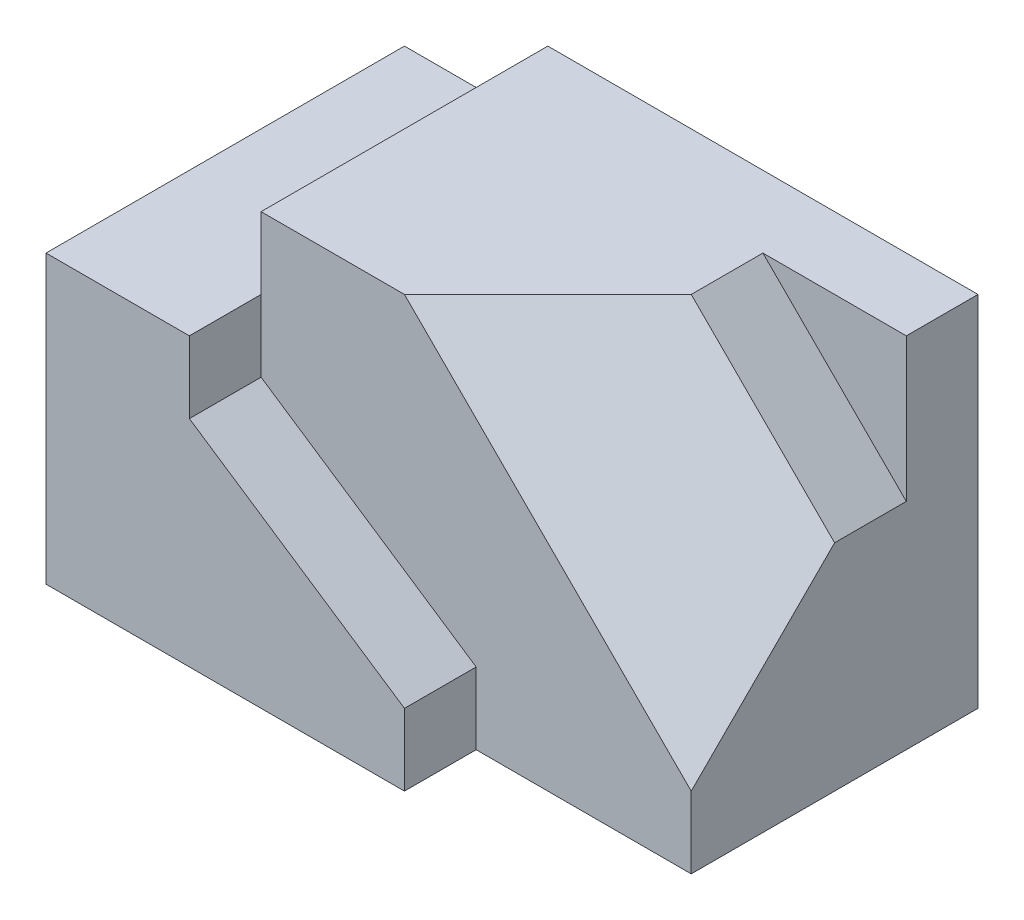
ISO-10303-21;
HEADER;
FILE_DESCRIPTION(('STEP AP214'),'2;1');
FILE_NAME('part.step','',(''),(''),'','','');
FILE_SCHEMA(('AUTOMOTIVE_DESIGN { 1 0 10303 214 1 1 1 1 }'));
ENDSEC;
DATA;
#1=APPLICATION_CONTEXT('core data for automotive mechanical design processes');
#2=APPLICATION_PROTOCOL_DEFINITION('international standard','automotive_design',2000,#1);
#3=PRODUCT_CONTEXT('',#1,'mechanical');
#4=PRODUCT('Part','Part','',(#3));
#5=PRODUCT_RELATED_PRODUCT_CATEGORY('part','',(#4));
#6=PRODUCT_DEFINITION_FORMATION('','',#4);
#7=PRODUCT_DEFINITION_CONTEXT('part definition',#1,'design');
#8=PRODUCT_DEFINITION('design','',#6,#7);
#9=PRODUCT_DEFINITION_SHAPE('','',#8);
#10=(LENGTH_UNIT() NAMED_UNIT(*) SI_UNIT(.MILLI.,.METRE.));
#11=(NAMED_UNIT(*) PLANE_ANGLE_UNIT() SI_UNIT($,.RADIAN.));
#12=(NAMED_UNIT(*) SI_UNIT($,.STERADIAN.) SOLID_ANGLE_UNIT());
#13=UNCERTAINTY_MEASURE_WITH_UNIT(LENGTH_MEASURE(1.E-05),#10,'distance_accuracy_value','');
#14=(GEOMETRIC_REPRESENTATION_CONTEXT(3) GLOBAL_UNCERTAINTY_ASSIGNED_CONTEXT((#13)) GLOBAL_UNIT_ASSIGNED_CONTEXT((#10,
#11,#12)) REPRESENTATION_CONTEXT('',''));
#15=CARTESIAN_POINT('',(0.,0.,0.));
#16=DIRECTION('',(0.,0.,1.));
#17=DIRECTION('',(1.,0.,0.));
#18=AXIS2_PLACEMENT_3D('',#15,#16,#17);
#19=CARTESIAN_POINT('',(80.,0.,-10.));
#20=DIRECTION('',(0.,0.,-1.));
#21=DIRECTION('',(-1.,0.,0.));
#22=AXIS2_PLACEMENT_3D('',#19,#20,#21);
#23=PLANE('',#22);
#24=DIRECTION('',(0.,1.,0.));
#25=VECTOR('',#24,1.);
#26=CARTESIAN_POINT('',(80.,0.,-10.));
#27=LINE('',#26,#25);
#28=CARTESIAN_POINT('',(80.,0.,-10.));
#29=VERTEX_POINT('',#28);
#30=CARTESIAN_POINT('',(80.,10.,-9.99999999999998));
#31=VERTEX_POINT('',#30);
#32=EDGE_CURVE('E142',#29,#31,#27,.T.);
#33=ORIENTED_EDGE('',*,*,#32,.T.);
#34=DIRECTION('',(-0.707106781186547,0.707106781186548,0.));
#35=VECTOR('',#34,1.);
#36=CARTESIAN_POINT('',(80.,10.,-9.99999999999998));
#37=LINE('',#36,#35);
#38=CARTESIAN_POINT('',(40.,50.,-9.99999999999998));
#39=VERTEX_POINT('',#38);
#40=EDGE_CURVE('E130',#31,#39,#37,.T.);
#41=ORIENTED_EDGE('',*,*,#40,.T.);
#42=DIRECTION('',(1.,0.,0.));
#43=VECTOR('',#42,1.);
#44=CARTESIAN_POINT('',(80.,50.,-10.));
#45=LINE('',#44,#43);
#46=CARTESIAN_POINT('',(20.,50.,-9.99999999999999));
#47=VERTEX_POINT('',#46);
#48=EDGE_CURVE('E140',#47,#39,#45,.T.);
#49=ORIENTED_EDGE('',*,*,#48,.F.);
#50=DIRECTION('',(0.,-1.,0.));
#51=VECTOR('',#50,1.);
#52=CARTESIAN_POINT('',(20.,50.,-9.99999999999999));
#53=LINE('',#52,#51);
#54=CARTESIAN_POINT('',(20.,40.,-9.99999999999999));
#55=VERTEX_POINT('',#54);
#56=EDGE_CURVE('E150',#47,#55,#53,.T.);
#57=ORIENTED_EDGE('',*,*,#56,.T.);
#58=CARTESIAN_POINT('',(20.,30.,-9.99999999999999));
#59=VERTEX_POINT('',#58);
#60=EDGE_CURVE('E148',#55,#59,#53,.T.);
#61=ORIENTED_EDGE('',*,*,#60,.T.);
#62=DIRECTION('',(-0.832050294337844,0.554700196225229,0.));
#63=VECTOR('',#62,1.);
#64=CARTESIAN_POINT('',(75.3846153846154,-6.92307692307693,-10.));
#65=LINE('',#64,#63);
#66=CARTESIAN_POINT('',(50.,10.,-10.));
#67=VERTEX_POINT('',#66);
#68=EDGE_CURVE('E225',#67,#59,#65,.T.);
#69=ORIENTED_EDGE('',*,*,#68,.F.);
#70=DIRECTION('',(0.,1.,0.));
#71=VECTOR('',#70,1.);
#72=CARTESIAN_POINT('',(50.,0.,-10.));
#73=LINE('',#72,#71);
#74=CARTESIAN_POINT('',(50.,0.,-10.));
#75=VERTEX_POINT('',#74);
#76=EDGE_CURVE('E168',#75,#67,#73,.T.);
#77=ORIENTED_EDGE('',*,*,#76,.F.);
#78=DIRECTION('',(-1.,0.,0.));
#79=VECTOR('',#78,1.);
#80=CARTESIAN_POINT('',(80.,0.,-10.));
#81=LINE('',#80,#79);
#82=EDGE_CURVE('E157',#29,#75,#81,.T.);
#83=ORIENTED_EDGE('',*,*,#82,.F.);
#84=EDGE_LOOP('',(#33,#41,#49,#57,#61,#69,#77,#83));
#85=FACE_BOUND('',#84,.T.);
#86=ADVANCED_FACE('F35',(#85),#23,.F.);
#87=CARTESIAN_POINT('',(80.,10.,0.));
#88=DIRECTION('',(-1.,0.,0.));
#89=DIRECTION('',(0.,0.,1.));
#90=AXIS2_PLACEMENT_3D('',#87,#88,#89);
#91=PLANE('',#90);
#92=DIRECTION('',(0.,0.,-1.));
#93=VECTOR('',#92,1.);
#94=CARTESIAN_POINT('',(80.,30.,10.));
#95=LINE('',#94,#93);
#96=CARTESIAN_POINT('',(80.,30.,-29.9999999999999));
#97=VERTEX_POINT('',#96);
#98=CARTESIAN_POINT('',(80.,30.,-40.));
#99=VERTEX_POINT('',#98);
#100=EDGE_CURVE('E212',#97,#99,#95,.T.);
#101=ORIENTED_EDGE('',*,*,#100,.F.);
#102=DIRECTION('',(0.,-0.707106781186548,0.707106781186547));
#103=VECTOR('',#102,1.);
#104=CARTESIAN_POINT('',(80.,30.,-30.));
#105=LINE('',#104,#103);
#106=EDGE_CURVE('E50',#97,#31,#105,.T.);
#107=ORIENTED_EDGE('',*,*,#106,.T.);
#108=ORIENTED_EDGE('',*,*,#32,.F.);
#109=DIRECTION('',(0.,0.,-1.));
#110=VECTOR('',#109,1.);
#111=CARTESIAN_POINT('',(80.,0.,0.));
#112=LINE('',#111,#110);
#113=CARTESIAN_POINT('',(80.,0.,-50.));
#114=VERTEX_POINT('',#113);
#115=EDGE_CURVE('E175',#29,#114,#112,.T.);
#116=ORIENTED_EDGE('',*,*,#115,.T.);
#117=DIRECTION('',(0.,-1.,0.));
#118=VECTOR('',#117,1.);
#119=CARTESIAN_POINT('',(80.,10.,-50.));
#120=LINE('',#119,#118);
#121=CARTESIAN_POINT('',(80.,50.,-50.));
#122=VERTEX_POINT('',#121);
#123=EDGE_CURVE('E182',#122,#114,#120,.T.);
#124=ORIENTED_EDGE('',*,*,#123,.F.);
#125=DIRECTION('',(0.,0.,-1.));
#126=VECTOR('',#125,1.);
#127=CARTESIAN_POINT('',(80.,50.,-50.));
#128=LINE('',#127,#126);
#129=CARTESIAN_POINT('',(80.,50.,-40.));
#130=VERTEX_POINT('',#129);
#131=EDGE_CURVE('E231',#130,#122,#128,.T.);
#132=ORIENTED_EDGE('',*,*,#131,.F.);
#133=DIRECTION('',(0.,1.,0.));
#134=VECTOR('',#133,1.);
#135=CARTESIAN_POINT('',(80.,30.,-40.));
#136=LINE('',#135,#134);
#137=EDGE_CURVE('E58',#99,#130,#136,.T.);
#138=ORIENTED_EDGE('',*,*,#137,.F.);
#139=EDGE_LOOP('',(#101,#107,#108,#116,#124,#132,#138));
#140=FACE_BOUND('',#139,.T.);
#141=ADVANCED_FACE('F261',(#140),#91,.F.);
#142=CARTESIAN_POINT('',(0.,50.,0.));
#143=DIRECTION('',(0.,-1.,0.));
#144=DIRECTION('',(0.,0.,-1.));
#145=AXIS2_PLACEMENT_3D('',#142,#143,#144);
#146=PLANE('',#145);
#147=ORIENTED_EDGE('',*,*,#48,.T.);
#148=DIRECTION('',(0.707106781186548,0.,-0.707106781186547));
#149=VECTOR('',#148,1.);
#150=CARTESIAN_POINT('',(40.,50.,-9.99999999999998));
#151=LINE('',#150,#149);
#152=CARTESIAN_POINT('',(60.0000000000001,50.,-30.));
#153=VERTEX_POINT('',#152);
#154=EDGE_CURVE('E127',#39,#153,#151,.T.);
#155=ORIENTED_EDGE('',*,*,#154,.T.);
#156=DIRECTION('',(0.,0.,1.));
#157=VECTOR('',#156,1.);
#158=CARTESIAN_POINT('',(60.,50.,0.));
#159=LINE('',#158,#157);
#160=CARTESIAN_POINT('',(60.,50.,-40.));
#161=VERTEX_POINT('',#160);
#162=EDGE_CURVE('E11',#161,#153,#159,.T.);
#163=ORIENTED_EDGE('',*,*,#162,.F.);
#164=DIRECTION('',(-1.,0.,0.));
#165=VECTOR('',#164,1.);
#166=CARTESIAN_POINT('',(80.,50.,-40.));
#167=LINE('',#166,#165);
#168=EDGE_CURVE('E262',#130,#161,#167,.T.);
#169=ORIENTED_EDGE('',*,*,#168,.F.);
#170=ORIENTED_EDGE('',*,*,#131,.T.);
#171=DIRECTION('',(-1.,0.,0.));
#172=VECTOR('',#171,1.);
#173=CARTESIAN_POINT('',(80.,50.,-50.));
#174=LINE('',#173,#172);
#175=CARTESIAN_POINT('',(20.,50.,-50.));
#176=VERTEX_POINT('',#175);
#177=EDGE_CURVE('E152',#122,#176,#174,.T.);
#178=ORIENTED_EDGE('',*,*,#177,.T.);
#179=DIRECTION('',(0.,0.,1.));
#180=VECTOR('',#179,1.);
#181=CARTESIAN_POINT('',(20.,50.,-50.));
#182=LINE('',#181,#180);
#183=EDGE_CURVE('E146',#176,#47,#182,.T.);
#184=ORIENTED_EDGE('',*,*,#183,.T.);
#185=EDGE_LOOP('',(#147,#155,#163,#169,#170,#178,#184));
#186=FACE_BOUND('',#185,.T.);
#187=ADVANCED_FACE('F144',(#186),#146,.F.);
#188=CARTESIAN_POINT('',(20.,50.,-50.));
#189=DIRECTION('',(1.,0.,0.));
#190=DIRECTION('',(0.,0.,-1.));
#191=AXIS2_PLACEMENT_3D('',#188,#189,#190);
#192=PLANE('',#191);
#193=DIRECTION('',(0.,0.,1.));
#194=VECTOR('',#193,1.);
#195=CARTESIAN_POINT('',(20.,40.,-50.));
#196=LINE('',#195,#194);
#197=CARTESIAN_POINT('',(20.,40.,-50.));
#198=VERTEX_POINT('',#197);
#199=EDGE_CURVE('E226',#198,#55,#196,.T.);
#200=ORIENTED_EDGE('',*,*,#199,.T.);
#201=ORIENTED_EDGE('',*,*,#56,.F.);
#202=ORIENTED_EDGE('',*,*,#183,.F.);
#203=DIRECTION('',(0.,-1.,0.));
#204=VECTOR('',#203,1.);
#205=CARTESIAN_POINT('',(20.,50.,-50.));
#206=LINE('',#205,#204);
#207=EDGE_CURVE('E156',#176,#198,#206,.T.);
#208=ORIENTED_EDGE('',*,*,#207,.T.);
#209=EDGE_LOOP('',(#200,#201,#202,#208));
#210=FACE_BOUND('',#209,.T.);
#211=ADVANCED_FACE('F244',(#210),#192,.F.);
#212=CARTESIAN_POINT('',(0.,10.,0.));
#213=DIRECTION('',(1.,0.,0.));
#214=DIRECTION('',(0.,0.,-1.));
#215=AXIS2_PLACEMENT_3D('',#212,#213,#214);
#216=PLANE('',#215);
#217=DIRECTION('',(0.,0.,1.));
#218=VECTOR('',#217,1.);
#219=CARTESIAN_POINT('',(0.,0.,0.));
#220=LINE('',#219,#218);
#221=CARTESIAN_POINT('',(0.,0.,-50.));
#222=VERTEX_POINT('',#221);
#223=CARTESIAN_POINT('',(0.,0.,0.));
#224=VERTEX_POINT('',#223);
#225=EDGE_CURVE('E167',#222,#224,#220,.T.);
#226=ORIENTED_EDGE('',*,*,#225,.T.);
#227=DIRECTION('',(0.,-1.,0.));
#228=VECTOR('',#227,1.);
#229=CARTESIAN_POINT('',(0.,10.,0.));
#230=LINE('',#229,#228);
#231=CARTESIAN_POINT('',(0.,40.,0.));
#232=VERTEX_POINT('',#231);
#233=EDGE_CURVE('E43',#232,#224,#230,.T.);
#234=ORIENTED_EDGE('',*,*,#233,.F.);
#235=DIRECTION('',(0.,0.,1.));
#236=VECTOR('',#235,1.);
#237=CARTESIAN_POINT('',(0.,40.,-50.));
#238=LINE('',#237,#236);
#239=CARTESIAN_POINT('',(0.,40.,-50.));
#240=VERTEX_POINT('',#239);
#241=EDGE_CURVE('E222',#240,#232,#238,.T.);
#242=ORIENTED_EDGE('',*,*,#241,.F.);
#243=DIRECTION('',(0.,-1.,0.));
#244=VECTOR('',#243,1.);
#245=CARTESIAN_POINT('',(0.,10.,-50.));
#246=LINE('',#245,#244);
#247=EDGE_CURVE('E179',#240,#222,#246,.T.);
#248=ORIENTED_EDGE('',*,*,#247,.T.);
#249=EDGE_LOOP('',(#226,#234,#242,#248));
#250=FACE_BOUND('',#249,.T.);
#251=ADVANCED_FACE('F37',(#250),#216,.F.);
#252=CARTESIAN_POINT('',(0.,10.,0.));
#253=DIRECTION('',(0.,0.,-1.));
#254=DIRECTION('',(-1.,0.,0.));
#255=AXIS2_PLACEMENT_3D('',#252,#253,#254);
#256=PLANE('',#255);
#257=DIRECTION('',(1.,0.,0.));
#258=VECTOR('',#257,1.);
#259=CARTESIAN_POINT('',(0.,0.,0.));
#260=LINE('',#259,#258);
#261=CARTESIAN_POINT('',(50.,0.,0.));
#262=VERTEX_POINT('',#261);
#263=EDGE_CURVE('E172',#224,#262,#260,.T.);
#264=ORIENTED_EDGE('',*,*,#263,.T.);
#265=DIRECTION('',(0.,1.,0.));
#266=VECTOR('',#265,1.);
#267=CARTESIAN_POINT('',(50.,0.,0.));
#268=LINE('',#267,#266);
#269=CARTESIAN_POINT('',(50.,10.,0.));
#270=VERTEX_POINT('',#269);
#271=EDGE_CURVE('E164',#262,#270,#268,.T.);
#272=ORIENTED_EDGE('',*,*,#271,.T.);
#273=DIRECTION('',(0.832050294337844,-0.554700196225229,0.));
#274=VECTOR('',#273,1.);
#275=CARTESIAN_POINT('',(20.,30.,0.));
#276=LINE('',#275,#274);
#277=CARTESIAN_POINT('',(20.,30.,0.));
#278=VERTEX_POINT('',#277);
#279=EDGE_CURVE('E206',#278,#270,#276,.T.);
#280=ORIENTED_EDGE('',*,*,#279,.F.);
#281=DIRECTION('',(0.,-1.,0.));
#282=VECTOR('',#281,1.);
#283=CARTESIAN_POINT('',(20.,0.,0.));
#284=LINE('',#283,#282);
#285=CARTESIAN_POINT('',(20.,40.,0.));
#286=VERTEX_POINT('',#285);
#287=EDGE_CURVE('E211',#286,#278,#284,.T.);
#288=ORIENTED_EDGE('',*,*,#287,.F.);
#289=DIRECTION('',(1.,0.,0.));
#290=VECTOR('',#289,1.);
#291=CARTESIAN_POINT('',(0.,40.,0.));
#292=LINE('',#291,#290);
#293=EDGE_CURVE('E214',#232,#286,#292,.T.);
#294=ORIENTED_EDGE('',*,*,#293,.F.);
#295=ORIENTED_EDGE('',*,*,#233,.T.);
#296=EDGE_LOOP('',(#264,#272,#280,#288,#294,#295));
#297=FACE_BOUND('',#296,.T.);
#298=ADVANCED_FACE('F204',(#297),#256,.F.);
#299=CARTESIAN_POINT('',(0.,10.,-50.));
#300=DIRECTION('',(0.,0.,1.));
#301=DIRECTION('',(1.,0.,0.));
#302=AXIS2_PLACEMENT_3D('',#299,#300,#301);
#303=PLANE('',#302);
#304=ORIENTED_EDGE('',*,*,#247,.F.);
#305=DIRECTION('',(1.,0.,0.));
#306=VECTOR('',#305,1.);
#307=CARTESIAN_POINT('',(0.,40.,-50.));
#308=LINE('',#307,#306);
#309=EDGE_CURVE('E218',#240,#198,#308,.T.);
#310=ORIENTED_EDGE('',*,*,#309,.T.);
#311=ORIENTED_EDGE('',*,*,#207,.F.);
#312=ORIENTED_EDGE('',*,*,#177,.F.);
#313=ORIENTED_EDGE('',*,*,#123,.T.);
#314=DIRECTION('',(-1.,0.,0.));
#315=VECTOR('',#314,1.);
#316=CARTESIAN_POINT('',(0.,0.,-50.));
#317=LINE('',#316,#315);
#318=EDGE_CURVE('E177',#114,#222,#317,.T.);
#319=ORIENTED_EDGE('',*,*,#318,.T.);
#320=EDGE_LOOP('',(#304,#310,#311,#312,#313,#319));
#321=FACE_BOUND('',#320,.T.);
#322=ADVANCED_FACE('F240',(#321),#303,.F.);
#323=CARTESIAN_POINT('',(0.,0.,0.));
#324=DIRECTION('',(0.,-1.,0.));
#325=DIRECTION('',(0.,0.,-1.));
#326=AXIS2_PLACEMENT_3D('',#323,#324,#325);
#327=PLANE('',#326);
#328=DIRECTION('',(0.,0.,1.));
#329=VECTOR('',#328,1.);
#330=CARTESIAN_POINT('',(50.,0.,0.));
#331=LINE('',#330,#329);
#332=EDGE_CURVE('E160',#75,#262,#331,.T.);
#333=ORIENTED_EDGE('',*,*,#332,.T.);
#334=ORIENTED_EDGE('',*,*,#263,.F.);
#335=ORIENTED_EDGE('',*,*,#225,.F.);
#336=ORIENTED_EDGE('',*,*,#318,.F.);
#337=ORIENTED_EDGE('',*,*,#115,.F.);
#338=ORIENTED_EDGE('',*,*,#82,.T.);
#339=EDGE_LOOP('',(#333,#334,#335,#336,#337,#338));
#340=FACE_BOUND('',#339,.T.);
#341=ADVANCED_FACE('F257',(#340),#327,.T.);
#342=CARTESIAN_POINT('',(50.,0.,0.));
#343=DIRECTION('',(-1.,0.,0.));
#344=DIRECTION('',(0.,0.,1.));
#345=AXIS2_PLACEMENT_3D('',#342,#343,#344);
#346=PLANE('',#345);
#347=DIRECTION('',(0.,0.,1.));
#348=VECTOR('',#347,1.);
#349=CARTESIAN_POINT('',(50.,10.,0.));
#350=LINE('',#349,#348);
#351=EDGE_CURVE('E161',#67,#270,#350,.T.);
#352=ORIENTED_EDGE('',*,*,#351,.T.);
#353=ORIENTED_EDGE('',*,*,#271,.F.);
#354=ORIENTED_EDGE('',*,*,#332,.F.);
#355=ORIENTED_EDGE('',*,*,#76,.T.);
#356=EDGE_LOOP('',(#352,#353,#354,#355));
#357=FACE_BOUND('',#356,.T.);
#358=ADVANCED_FACE('F197',(#357),#346,.F.);
#359=CARTESIAN_POINT('',(20.,0.,-50.));
#360=DIRECTION('',(-1.,0.,0.));
#361=DIRECTION('',(0.,-1.,0.));
#362=AXIS2_PLACEMENT_3D('',#359,#360,#361);
#363=PLANE('',#362);
#364=DIRECTION('',(0.,0.,1.));
#365=VECTOR('',#364,1.);
#366=CARTESIAN_POINT('',(20.,30.,-50.));
#367=LINE('',#366,#365);
#368=EDGE_CURVE('E209',#59,#278,#367,.T.);
#369=ORIENTED_EDGE('',*,*,#368,.F.);
#370=ORIENTED_EDGE('',*,*,#60,.F.);
#371=EDGE_CURVE('E228',#55,#286,#196,.T.);
#372=ORIENTED_EDGE('',*,*,#371,.T.);
#373=ORIENTED_EDGE('',*,*,#287,.T.);
#374=EDGE_LOOP('',(#369,#370,#372,#373));
#375=FACE_BOUND('',#374,.T.);
#376=ADVANCED_FACE('F248',(#375),#363,.F.);
#377=CARTESIAN_POINT('',(20.,30.,-50.));
#378=DIRECTION('',(-0.554700196225229,-0.832050294337843,0.));
#379=DIRECTION('',(0.832050294337844,-0.554700196225229,0.));
#380=AXIS2_PLACEMENT_3D('',#377,#378,#379);
#381=PLANE('',#380);
#382=ORIENTED_EDGE('',*,*,#351,.F.);
#383=ORIENTED_EDGE('',*,*,#68,.T.);
#384=ORIENTED_EDGE('',*,*,#368,.T.);
#385=ORIENTED_EDGE('',*,*,#279,.T.);
#386=EDGE_LOOP('',(#382,#383,#384,#385));
#387=FACE_BOUND('',#386,.T.);
#388=ADVANCED_FACE('F207',(#387),#381,.F.);
#389=CARTESIAN_POINT('',(0.,40.,-50.));
#390=DIRECTION('',(0.,-1.,0.));
#391=DIRECTION('',(0.,0.,-1.));
#392=AXIS2_PLACEMENT_3D('',#389,#390,#391);
#393=PLANE('',#392);
#394=ORIENTED_EDGE('',*,*,#293,.T.);
#395=ORIENTED_EDGE('',*,*,#371,.F.);
#396=ORIENTED_EDGE('',*,*,#199,.F.);
#397=ORIENTED_EDGE('',*,*,#309,.F.);
#398=ORIENTED_EDGE('',*,*,#241,.T.);
#399=EDGE_LOOP('',(#394,#395,#396,#397,#398));
#400=FACE_BOUND('',#399,.T.);
#401=ADVANCED_FACE('F250',(#400),#393,.F.);
#402=CARTESIAN_POINT('',(60.,50.,10.));
#403=DIRECTION('',(0.707106781186548,0.707106781186547,0.));
#404=DIRECTION('',(-0.707106781186547,0.707106781186548,0.));
#405=AXIS2_PLACEMENT_3D('',#402,#403,#404);
#406=PLANE('',#405);
#407=DIRECTION('',(0.707106781186547,-0.707106781186548,0.));
#408=VECTOR('',#407,1.);
#409=CARTESIAN_POINT('',(60.0000000000001,50.,-30.));
#410=LINE('',#409,#408);
#411=EDGE_CURVE('E131',#153,#97,#410,.T.);
#412=ORIENTED_EDGE('',*,*,#411,.T.);
#413=ORIENTED_EDGE('',*,*,#100,.T.);
#414=DIRECTION('',(0.707106781186547,-0.707106781186548,0.));
#415=VECTOR('',#414,1.);
#416=CARTESIAN_POINT('',(60.,50.,-40.));
#417=LINE('',#416,#415);
#418=EDGE_CURVE('E264',#161,#99,#417,.T.);
#419=ORIENTED_EDGE('',*,*,#418,.F.);
#420=ORIENTED_EDGE('',*,*,#162,.T.);
#421=EDGE_LOOP('',(#412,#413,#419,#420));
#422=FACE_BOUND('',#421,.T.);
#423=ADVANCED_FACE('F271',(#422),#406,.T.);
#424=CARTESIAN_POINT('',(0.,0.,-40.));
#425=DIRECTION('',(0.,0.,-1.));
#426=DIRECTION('',(-1.,0.,0.));
#427=AXIS2_PLACEMENT_3D('',#424,#425,#426);
#428=PLANE('',#427);
#429=ORIENTED_EDGE('',*,*,#168,.T.);
#430=ORIENTED_EDGE('',*,*,#418,.T.);
#431=ORIENTED_EDGE('',*,*,#137,.T.);
#432=EDGE_LOOP('',(#429,#430,#431));
#433=FACE_BOUND('',#432,.T.);
#434=ADVANCED_FACE('F269',(#433),#428,.F.);
#435=CARTESIAN_POINT('',(26.6666666666667,26.6666666666667,26.6666666666667));
#436=DIRECTION('',(-0.577350269189626,-0.577350269189625,-0.577350269189626));
#437=DIRECTION('',(-0.707106781186548,0.,0.707106781186547));
#438=AXIS2_PLACEMENT_3D('',#435,#436,#437);
#439=PLANE('',#438);
#440=ORIENTED_EDGE('',*,*,#40,.F.);
#441=ORIENTED_EDGE('',*,*,#106,.F.);
#442=ORIENTED_EDGE('',*,*,#411,.F.);
#443=ORIENTED_EDGE('',*,*,#154,.F.);
#444=EDGE_LOOP('',(#440,#441,#442,#443));
#445=FACE_BOUND('',#444,.T.);
#446=ADVANCED_FACE('F129',(#445),#439,.F.);
#447=CLOSED_SHELL('',(#86,#141,#187,#211,#251,#298,#322,#341,#358,#376,#388,#401,#423,#434,#446));
#448=MANIFOLD_SOLID_BREP('B2',#447);
#449=ADVANCED_BREP_SHAPE_REPRESENTATION('',(#18,#448),#14);
#450=SHAPE_DEFINITION_REPRESENTATION(#9,#449);
ENDSEC;
END-ISO-10303-21;
